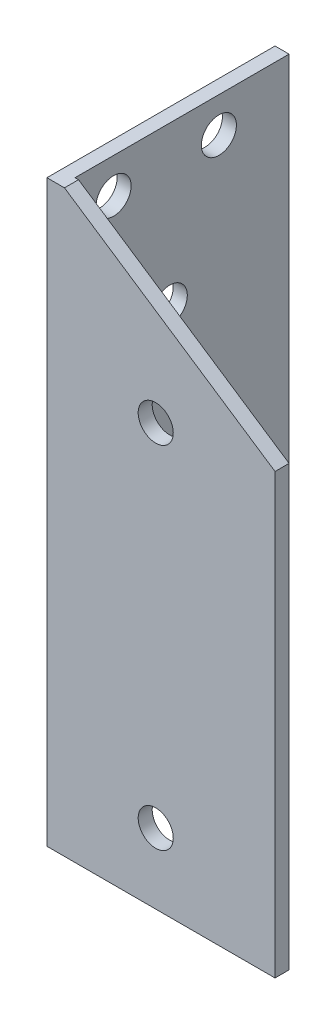
ISO-10303-21;
HEADER;
FILE_DESCRIPTION(('STEP AP214'),'2;1');
FILE_NAME('part.step','',(''),(''),'','','');
FILE_SCHEMA(('AUTOMOTIVE_DESIGN { 1 0 10303 214 1 1 1 1 }'));
ENDSEC;
DATA;
#1=APPLICATION_CONTEXT('core data for automotive mechanical design processes');
#2=APPLICATION_PROTOCOL_DEFINITION('international standard','automotive_design',2000,#1);
#3=PRODUCT_CONTEXT('',#1,'mechanical');
#4=PRODUCT('Part','Part','',(#3));
#5=PRODUCT_RELATED_PRODUCT_CATEGORY('part','',(#4));
#6=PRODUCT_DEFINITION_FORMATION('','',#4);
#7=PRODUCT_DEFINITION_CONTEXT('part definition',#1,'design');
#8=PRODUCT_DEFINITION('design','',#6,#7);
#9=PRODUCT_DEFINITION_SHAPE('','',#8);
#10=(LENGTH_UNIT() NAMED_UNIT(*) SI_UNIT(.MILLI.,.METRE.));
#11=(NAMED_UNIT(*) PLANE_ANGLE_UNIT() SI_UNIT($,.RADIAN.));
#12=(NAMED_UNIT(*) SI_UNIT($,.STERADIAN.) SOLID_ANGLE_UNIT());
#13=UNCERTAINTY_MEASURE_WITH_UNIT(LENGTH_MEASURE(1.E-05),#10,'distance_accuracy_value','');
#14=(GEOMETRIC_REPRESENTATION_CONTEXT(3) GLOBAL_UNCERTAINTY_ASSIGNED_CONTEXT((#13)) GLOBAL_UNIT_ASSIGNED_CONTEXT((#10,
#11,#12)) REPRESENTATION_CONTEXT('',''));
#15=CARTESIAN_POINT('',(0.,0.,0.));
#16=DIRECTION('',(0.,0.,1.));
#17=DIRECTION('',(1.,0.,0.));
#18=AXIS2_PLACEMENT_3D('',#15,#16,#17);
#19=CARTESIAN_POINT('',(4.,165.,0.));
#20=DIRECTION('',(-1.,0.,0.));
#21=DIRECTION('',(0.,0.,1.));
#22=AXIS2_PLACEMENT_3D('',#19,#20,#21);
#23=PLANE('',#22);
#24=CARTESIAN_POINT('',(4.,20.,-30.9999999999947));
#25=DIRECTION('',(-1.,0.,0.));
#26=DIRECTION('',(0.,0.,1.));
#27=AXIS2_PLACEMENT_3D('',#24,#25,#26);
#28=CIRCLE('',#27,4.99999999999998);
#29=CARTESIAN_POINT('',(4.,20.,-25.9999999999947));
#30=VERTEX_POINT('',#29);
#31=EDGE_CURVE('E140',#30,#30,#28,.T.);
#32=ORIENTED_EDGE('',*,*,#31,.T.);
#33=EDGE_LOOP('',(#32));
#34=FACE_BOUND('',#33,.T.);
#35=CARTESIAN_POINT('',(4.,155.,-15.));
#36=DIRECTION('',(-1.,0.,0.));
#37=DIRECTION('',(0.,0.,1.));
#38=AXIS2_PLACEMENT_3D('',#35,#36,#37);
#39=CIRCLE('',#38,5.);
#40=CARTESIAN_POINT('',(4.,155.,-10.));
#41=VERTEX_POINT('',#40);
#42=EDGE_CURVE('E137',#41,#41,#39,.T.);
#43=ORIENTED_EDGE('',*,*,#42,.T.);
#44=EDGE_LOOP('',(#43));
#45=FACE_BOUND('',#44,.T.);
#46=CARTESIAN_POINT('',(4.,155.,-45.));
#47=DIRECTION('',(-1.,0.,0.));
#48=DIRECTION('',(0.,0.,1.));
#49=AXIS2_PLACEMENT_3D('',#46,#47,#48);
#50=CIRCLE('',#49,5.00000000000001);
#51=CARTESIAN_POINT('',(4.,155.,-40.));
#52=VERTEX_POINT('',#51);
#53=EDGE_CURVE('E129',#52,#52,#50,.T.);
#54=ORIENTED_EDGE('',*,*,#53,.T.);
#55=EDGE_LOOP('',(#54));
#56=FACE_BOUND('',#55,.T.);
#57=CARTESIAN_POINT('',(4.,120.,-31.));
#58=DIRECTION('',(-1.,0.,0.));
#59=DIRECTION('',(0.,0.,1.));
#60=AXIS2_PLACEMENT_3D('',#57,#58,#59);
#61=CIRCLE('',#60,4.99999999999999);
#62=CARTESIAN_POINT('',(4.,120.,-26.));
#63=VERTEX_POINT('',#62);
#64=EDGE_CURVE('E146',#63,#63,#61,.T.);
#65=ORIENTED_EDGE('',*,*,#64,.T.);
#66=EDGE_LOOP('',(#65));
#67=FACE_BOUND('',#66,.T.);
#68=DIRECTION('',(0.,0.,-1.));
#69=VECTOR('',#68,1.);
#70=CARTESIAN_POINT('',(4.,0.,0.));
#71=LINE('',#70,#69);
#72=CARTESIAN_POINT('',(4.,0.,-4.));
#73=VERTEX_POINT('',#72);
#74=CARTESIAN_POINT('',(4.,0.,-65.));
#75=VERTEX_POINT('',#74);
#76=EDGE_CURVE('E163',#73,#75,#71,.T.);
#77=ORIENTED_EDGE('',*,*,#76,.T.);
#78=DIRECTION('',(0.,-1.,0.));
#79=VECTOR('',#78,1.);
#80=CARTESIAN_POINT('',(4.,165.,-65.));
#81=LINE('',#80,#79);
#82=CARTESIAN_POINT('',(4.,165.,-65.));
#83=VERTEX_POINT('',#82);
#84=EDGE_CURVE('E44',#83,#75,#81,.T.);
#85=ORIENTED_EDGE('',*,*,#84,.F.);
#86=DIRECTION('',(0.,0.,-1.));
#87=VECTOR('',#86,1.);
#88=CARTESIAN_POINT('',(4.,165.,0.));
#89=LINE('',#88,#87);
#90=CARTESIAN_POINT('',(4.,165.,-4.));
#91=VERTEX_POINT('',#90);
#92=EDGE_CURVE('E157',#91,#83,#89,.T.);
#93=ORIENTED_EDGE('',*,*,#92,.F.);
#94=DIRECTION('',(0.,-1.,0.));
#95=VECTOR('',#94,1.);
#96=CARTESIAN_POINT('',(4.,165.,-4.));
#97=LINE('',#96,#95);
#98=EDGE_CURVE('E162',#91,#73,#97,.T.);
#99=ORIENTED_EDGE('',*,*,#98,.T.);
#100=EDGE_LOOP('',(#77,#85,#93,#99));
#101=FACE_BOUND('',#100,.T.);
#102=ADVANCED_FACE('F37',(#34,#45,#56,#67,#101),#23,.F.);
#103=CARTESIAN_POINT('',(0.,165.,-65.));
#104=DIRECTION('',(0.,0.,-1.));
#105=DIRECTION('',(-1.,0.,0.));
#106=AXIS2_PLACEMENT_3D('',#103,#104,#105);
#107=PLANE('',#106);
#108=DIRECTION('',(1.,0.,0.));
#109=VECTOR('',#108,1.);
#110=CARTESIAN_POINT('',(0.,0.,-65.));
#111=LINE('',#110,#109);
#112=CARTESIAN_POINT('',(0.,0.,-65.));
#113=VERTEX_POINT('',#112);
#114=EDGE_CURVE('E166',#113,#75,#111,.T.);
#115=ORIENTED_EDGE('',*,*,#114,.F.);
#116=DIRECTION('',(0.,-1.,0.));
#117=VECTOR('',#116,1.);
#118=CARTESIAN_POINT('',(0.,165.,-65.));
#119=LINE('',#118,#117);
#120=CARTESIAN_POINT('',(0.,165.,-65.));
#121=VERTEX_POINT('',#120);
#122=EDGE_CURVE('E181',#121,#113,#119,.T.);
#123=ORIENTED_EDGE('',*,*,#122,.F.);
#124=DIRECTION('',(1.,0.,0.));
#125=VECTOR('',#124,1.);
#126=CARTESIAN_POINT('',(0.,165.,-65.));
#127=LINE('',#126,#125);
#128=EDGE_CURVE('E90',#121,#83,#127,.T.);
#129=ORIENTED_EDGE('',*,*,#128,.T.);
#130=ORIENTED_EDGE('',*,*,#84,.T.);
#131=EDGE_LOOP('',(#115,#123,#129,#130));
#132=FACE_BOUND('',#131,.T.);
#133=ADVANCED_FACE('F209',(#132),#107,.T.);
#134=CARTESIAN_POINT('',(0.,165.,0.));
#135=DIRECTION('',(-1.,0.,0.));
#136=DIRECTION('',(0.,0.,1.));
#137=AXIS2_PLACEMENT_3D('',#134,#135,#136);
#138=PLANE('',#137);
#139=CARTESIAN_POINT('',(0.,20.,-30.9999999999947));
#140=DIRECTION('',(-1.,0.,0.));
#141=DIRECTION('',(0.,0.,1.));
#142=AXIS2_PLACEMENT_3D('',#139,#140,#141);
#143=CIRCLE('',#142,4.99999999999998);
#144=CARTESIAN_POINT('',(0.,20.,-25.9999999999947));
#145=VERTEX_POINT('',#144);
#146=EDGE_CURVE('E126',#145,#145,#143,.T.);
#147=ORIENTED_EDGE('',*,*,#146,.F.);
#148=EDGE_LOOP('',(#147));
#149=FACE_BOUND('',#148,.T.);
#150=CARTESIAN_POINT('',(0.,155.,-15.));
#151=DIRECTION('',(-1.,0.,0.));
#152=DIRECTION('',(0.,0.,1.));
#153=AXIS2_PLACEMENT_3D('',#150,#151,#152);
#154=CIRCLE('',#153,5.);
#155=CARTESIAN_POINT('',(0.,155.,-10.));
#156=VERTEX_POINT('',#155);
#157=EDGE_CURVE('E130',#156,#156,#154,.T.);
#158=ORIENTED_EDGE('',*,*,#157,.F.);
#159=EDGE_LOOP('',(#158));
#160=FACE_BOUND('',#159,.T.);
#161=CARTESIAN_POINT('',(0.,155.,-45.));
#162=DIRECTION('',(-1.,0.,0.));
#163=DIRECTION('',(0.,0.,1.));
#164=AXIS2_PLACEMENT_3D('',#161,#162,#163);
#165=CIRCLE('',#164,5.00000000000001);
#166=CARTESIAN_POINT('',(0.,155.,-40.));
#167=VERTEX_POINT('',#166);
#168=EDGE_CURVE('E125',#167,#167,#165,.T.);
#169=ORIENTED_EDGE('',*,*,#168,.F.);
#170=EDGE_LOOP('',(#169));
#171=FACE_BOUND('',#170,.T.);
#172=CARTESIAN_POINT('',(0.,120.,-31.));
#173=DIRECTION('',(-1.,0.,0.));
#174=DIRECTION('',(0.,0.,1.));
#175=AXIS2_PLACEMENT_3D('',#172,#173,#174);
#176=CIRCLE('',#175,4.99999999999999);
#177=CARTESIAN_POINT('',(0.,120.,-26.));
#178=VERTEX_POINT('',#177);
#179=EDGE_CURVE('E143',#178,#178,#176,.T.);
#180=ORIENTED_EDGE('',*,*,#179,.F.);
#181=EDGE_LOOP('',(#180));
#182=FACE_BOUND('',#181,.T.);
#183=DIRECTION('',(0.,0.,-1.));
#184=VECTOR('',#183,1.);
#185=CARTESIAN_POINT('',(0.,0.,0.));
#186=LINE('',#185,#184);
#187=CARTESIAN_POINT('',(0.,0.,0.));
#188=VERTEX_POINT('',#187);
#189=EDGE_CURVE('E168',#188,#113,#186,.T.);
#190=ORIENTED_EDGE('',*,*,#189,.F.);
#191=DIRECTION('',(0.,-1.,0.));
#192=VECTOR('',#191,1.);
#193=CARTESIAN_POINT('',(0.,165.,0.));
#194=LINE('',#193,#192);
#195=CARTESIAN_POINT('',(0.,165.,0.));
#196=VERTEX_POINT('',#195);
#197=EDGE_CURVE('E179',#196,#188,#194,.T.);
#198=ORIENTED_EDGE('',*,*,#197,.F.);
#199=DIRECTION('',(0.,0.,-1.));
#200=VECTOR('',#199,1.);
#201=CARTESIAN_POINT('',(0.,165.,0.));
#202=LINE('',#201,#200);
#203=EDGE_CURVE('E109',#196,#121,#202,.T.);
#204=ORIENTED_EDGE('',*,*,#203,.T.);
#205=ORIENTED_EDGE('',*,*,#122,.T.);
#206=EDGE_LOOP('',(#190,#198,#204,#205));
#207=FACE_BOUND('',#206,.T.);
#208=ADVANCED_FACE('F214',(#149,#160,#171,#182,#207),#138,.T.);
#209=CARTESIAN_POINT('',(0.,165.,0.));
#210=DIRECTION('',(0.,0.,1.));
#211=DIRECTION('',(1.,0.,0.));
#212=AXIS2_PLACEMENT_3D('',#209,#210,#211);
#213=PLANE('',#212);
#214=DIRECTION('',(0.832050294337844,-0.554700196225229,0.));
#215=VECTOR('',#214,1.);
#216=CARTESIAN_POINT('',(5.00000000000001,165.,0.));
#217=LINE('',#216,#215);
#218=CARTESIAN_POINT('',(5.00000000000001,165.,0.));
#219=VERTEX_POINT('',#218);
#220=CARTESIAN_POINT('',(65.,125.,0.));
#221=VERTEX_POINT('',#220);
#222=EDGE_CURVE('E104',#219,#221,#217,.T.);
#223=ORIENTED_EDGE('',*,*,#222,.F.);
#224=DIRECTION('',(-1.,0.,0.));
#225=VECTOR('',#224,1.);
#226=CARTESIAN_POINT('',(0.,165.,0.));
#227=LINE('',#226,#225);
#228=EDGE_CURVE('E107',#219,#196,#227,.T.);
#229=ORIENTED_EDGE('',*,*,#228,.T.);
#230=ORIENTED_EDGE('',*,*,#197,.T.);
#231=DIRECTION('',(-1.,0.,0.));
#232=VECTOR('',#231,1.);
#233=CARTESIAN_POINT('',(0.,0.,0.));
#234=LINE('',#233,#232);
#235=CARTESIAN_POINT('',(65.,0.,0.));
#236=VERTEX_POINT('',#235);
#237=EDGE_CURVE('E170',#236,#188,#234,.T.);
#238=ORIENTED_EDGE('',*,*,#237,.F.);
#239=DIRECTION('',(0.,-1.,0.));
#240=VECTOR('',#239,1.);
#241=CARTESIAN_POINT('',(65.,165.,0.));
#242=LINE('',#241,#240);
#243=EDGE_CURVE('E119',#221,#236,#242,.T.);
#244=ORIENTED_EDGE('',*,*,#243,.F.);
#245=EDGE_LOOP('',(#223,#229,#230,#238,#244));
#246=FACE_BOUND('',#245,.T.);
#247=CARTESIAN_POINT('',(31.0000000000053,20.,0.));
#248=DIRECTION('',(0.,0.,1.));
#249=DIRECTION('',(1.,0.,0.));
#250=AXIS2_PLACEMENT_3D('',#247,#248,#249);
#251=CIRCLE('',#250,5.00000000000001);
#252=CARTESIAN_POINT('',(36.0000000000053,20.,0.));
#253=VERTEX_POINT('',#252);
#254=EDGE_CURVE('E149',#253,#253,#251,.T.);
#255=ORIENTED_EDGE('',*,*,#254,.F.);
#256=EDGE_LOOP('',(#255));
#257=FACE_BOUND('',#256,.T.);
#258=CARTESIAN_POINT('',(31.,120.,0.));
#259=DIRECTION('',(0.,0.,1.));
#260=DIRECTION('',(1.,0.,0.));
#261=AXIS2_PLACEMENT_3D('',#258,#259,#260);
#262=CIRCLE('',#261,4.99999999999999);
#263=CARTESIAN_POINT('',(36.,120.,0.));
#264=VERTEX_POINT('',#263);
#265=EDGE_CURVE('E153',#264,#264,#262,.T.);
#266=ORIENTED_EDGE('',*,*,#265,.F.);
#267=EDGE_LOOP('',(#266));
#268=FACE_BOUND('',#267,.T.);
#269=ADVANCED_FACE('F115',(#246,#257,#268),#213,.T.);
#270=CARTESIAN_POINT('',(65.,165.,-4.));
#271=DIRECTION('',(1.,0.,0.));
#272=DIRECTION('',(0.,0.,-1.));
#273=AXIS2_PLACEMENT_3D('',#270,#271,#272);
#274=PLANE('',#273);
#275=DIRECTION('',(0.,0.,1.));
#276=VECTOR('',#275,1.);
#277=CARTESIAN_POINT('',(65.,125.,-65.));
#278=LINE('',#277,#276);
#279=CARTESIAN_POINT('',(65.,125.,-4.));
#280=VERTEX_POINT('',#279);
#281=EDGE_CURVE('E120',#280,#221,#278,.T.);
#282=ORIENTED_EDGE('',*,*,#281,.T.);
#283=ORIENTED_EDGE('',*,*,#243,.T.);
#284=DIRECTION('',(0.,0.,1.));
#285=VECTOR('',#284,1.);
#286=CARTESIAN_POINT('',(65.,0.,-4.));
#287=LINE('',#286,#285);
#288=CARTESIAN_POINT('',(65.,0.,-4.));
#289=VERTEX_POINT('',#288);
#290=EDGE_CURVE('E172',#289,#236,#287,.T.);
#291=ORIENTED_EDGE('',*,*,#290,.F.);
#292=DIRECTION('',(0.,-1.,0.));
#293=VECTOR('',#292,1.);
#294=CARTESIAN_POINT('',(65.,165.,-4.));
#295=LINE('',#294,#293);
#296=EDGE_CURVE('E176',#280,#289,#295,.T.);
#297=ORIENTED_EDGE('',*,*,#296,.F.);
#298=EDGE_LOOP('',(#282,#283,#291,#297));
#299=FACE_BOUND('',#298,.T.);
#300=ADVANCED_FACE('F233',(#299),#274,.T.);
#301=CARTESIAN_POINT('',(0.,165.,-4.));
#302=DIRECTION('',(0.,0.,1.));
#303=DIRECTION('',(1.,0.,0.));
#304=AXIS2_PLACEMENT_3D('',#301,#302,#303);
#305=PLANE('',#304);
#306=CARTESIAN_POINT('',(31.0000000000053,20.,-4.));
#307=DIRECTION('',(0.,0.,1.));
#308=DIRECTION('',(1.,0.,0.));
#309=AXIS2_PLACEMENT_3D('',#306,#307,#308);
#310=CIRCLE('',#309,5.00000000000001);
#311=CARTESIAN_POINT('',(36.0000000000053,20.,-4.));
#312=VERTEX_POINT('',#311);
#313=EDGE_CURVE('E152',#312,#312,#310,.T.);
#314=ORIENTED_EDGE('',*,*,#313,.T.);
#315=EDGE_LOOP('',(#314));
#316=FACE_BOUND('',#315,.T.);
#317=CARTESIAN_POINT('',(31.,120.,-4.));
#318=DIRECTION('',(0.,0.,1.));
#319=DIRECTION('',(1.,0.,0.));
#320=AXIS2_PLACEMENT_3D('',#317,#318,#319);
#321=CIRCLE('',#320,4.99999999999999);
#322=CARTESIAN_POINT('',(36.,120.,-4.));
#323=VERTEX_POINT('',#322);
#324=EDGE_CURVE('E156',#323,#323,#321,.T.);
#325=ORIENTED_EDGE('',*,*,#324,.T.);
#326=EDGE_LOOP('',(#325));
#327=FACE_BOUND('',#326,.T.);
#328=DIRECTION('',(1.,0.,0.));
#329=VECTOR('',#328,1.);
#330=CARTESIAN_POINT('',(0.,165.,-4.));
#331=LINE('',#330,#329);
#332=CARTESIAN_POINT('',(5.00000000000001,165.,-4.));
#333=VERTEX_POINT('',#332);
#334=EDGE_CURVE('E55',#333,#91,#331,.F.);
#335=ORIENTED_EDGE('',*,*,#334,.F.);
#336=DIRECTION('',(0.832050294337844,-0.554700196225229,0.));
#337=VECTOR('',#336,1.);
#338=CARTESIAN_POINT('',(1.53846153846154,167.307692307692,-4.));
#339=LINE('',#338,#337);
#340=EDGE_CURVE('E105',#333,#280,#339,.T.);
#341=ORIENTED_EDGE('',*,*,#340,.T.);
#342=ORIENTED_EDGE('',*,*,#296,.T.);
#343=DIRECTION('',(1.,0.,0.));
#344=VECTOR('',#343,1.);
#345=CARTESIAN_POINT('',(0.,0.,-4.));
#346=LINE('',#345,#344);
#347=EDGE_CURVE('E82',#289,#73,#346,.F.);
#348=ORIENTED_EDGE('',*,*,#347,.T.);
#349=ORIENTED_EDGE('',*,*,#98,.F.);
#350=EDGE_LOOP('',(#335,#341,#342,#348,#349));
#351=FACE_BOUND('',#350,.T.);
#352=ADVANCED_FACE('F189',(#316,#327,#351),#305,.F.);
#353=CARTESIAN_POINT('',(0.,165.,0.));
#354=DIRECTION('',(0.,-1.,0.));
#355=DIRECTION('',(-1.,0.,0.));
#356=AXIS2_PLACEMENT_3D('',#353,#354,#355);
#357=PLANE('',#356);
#358=ORIENTED_EDGE('',*,*,#228,.F.);
#359=DIRECTION('',(0.,0.,-1.));
#360=VECTOR('',#359,1.);
#361=CARTESIAN_POINT('',(5.00000000000001,165.,0.));
#362=LINE('',#361,#360);
#363=EDGE_CURVE('E11',#219,#333,#362,.T.);
#364=ORIENTED_EDGE('',*,*,#363,.T.);
#365=ORIENTED_EDGE('',*,*,#334,.T.);
#366=ORIENTED_EDGE('',*,*,#92,.T.);
#367=ORIENTED_EDGE('',*,*,#128,.F.);
#368=ORIENTED_EDGE('',*,*,#203,.F.);
#369=EDGE_LOOP('',(#358,#364,#365,#366,#367,#368));
#370=FACE_BOUND('',#369,.T.);
#371=ADVANCED_FACE('F108',(#370),#357,.F.);
#372=CARTESIAN_POINT('',(0.,0.,0.));
#373=DIRECTION('',(0.,-1.,0.));
#374=DIRECTION('',(-1.,0.,0.));
#375=AXIS2_PLACEMENT_3D('',#372,#373,#374);
#376=PLANE('',#375);
#377=ORIENTED_EDGE('',*,*,#76,.F.);
#378=ORIENTED_EDGE('',*,*,#347,.F.);
#379=ORIENTED_EDGE('',*,*,#290,.T.);
#380=ORIENTED_EDGE('',*,*,#237,.T.);
#381=ORIENTED_EDGE('',*,*,#189,.T.);
#382=ORIENTED_EDGE('',*,*,#114,.T.);
#383=EDGE_LOOP('',(#377,#378,#379,#380,#381,#382));
#384=FACE_BOUND('',#383,.T.);
#385=ADVANCED_FACE('F205',(#384),#376,.T.);
#386=CARTESIAN_POINT('',(31.,120.,-10.));
#387=DIRECTION('',(0.,0.,1.));
#388=DIRECTION('',(1.,0.,0.));
#389=AXIS2_PLACEMENT_3D('',#386,#387,#388);
#390=CYLINDRICAL_SURFACE('',#389,4.99999999999999);
#391=ORIENTED_EDGE('',*,*,#265,.T.);
#392=EDGE_LOOP('',(#391));
#393=FACE_BOUND('',#392,.T.);
#394=ORIENTED_EDGE('',*,*,#324,.F.);
#395=EDGE_LOOP('',(#394));
#396=FACE_BOUND('',#395,.T.);
#397=ADVANCED_FACE('F195',(#393,#396),#390,.F.);
#398=CARTESIAN_POINT('',(31.0000000000053,20.,-10.));
#399=DIRECTION('',(0.,0.,1.));
#400=DIRECTION('',(1.,0.,0.));
#401=AXIS2_PLACEMENT_3D('',#398,#399,#400);
#402=CYLINDRICAL_SURFACE('',#401,5.00000000000001);
#403=ORIENTED_EDGE('',*,*,#254,.T.);
#404=EDGE_LOOP('',(#403));
#405=FACE_BOUND('',#404,.T.);
#406=ORIENTED_EDGE('',*,*,#313,.F.);
#407=EDGE_LOOP('',(#406));
#408=FACE_BOUND('',#407,.T.);
#409=ADVANCED_FACE('F192',(#405,#408),#402,.F.);
#410=CARTESIAN_POINT('',(10.,120.,-31.));
#411=DIRECTION('',(-1.,0.,0.));
#412=DIRECTION('',(0.,0.,1.));
#413=AXIS2_PLACEMENT_3D('',#410,#411,#412);
#414=CYLINDRICAL_SURFACE('',#413,4.99999999999999);
#415=ORIENTED_EDGE('',*,*,#179,.T.);
#416=EDGE_LOOP('',(#415));
#417=FACE_BOUND('',#416,.T.);
#418=ORIENTED_EDGE('',*,*,#64,.F.);
#419=EDGE_LOOP('',(#418));
#420=FACE_BOUND('',#419,.T.);
#421=ADVANCED_FACE('F194',(#417,#420),#414,.F.);
#422=CARTESIAN_POINT('',(10.,155.,-45.));
#423=DIRECTION('',(-1.,0.,0.));
#424=DIRECTION('',(0.,0.,1.));
#425=AXIS2_PLACEMENT_3D('',#422,#423,#424);
#426=CYLINDRICAL_SURFACE('',#425,5.00000000000001);
#427=ORIENTED_EDGE('',*,*,#168,.T.);
#428=EDGE_LOOP('',(#427));
#429=FACE_BOUND('',#428,.T.);
#430=ORIENTED_EDGE('',*,*,#53,.F.);
#431=EDGE_LOOP('',(#430));
#432=FACE_BOUND('',#431,.T.);
#433=ADVANCED_FACE('F202',(#429,#432),#426,.F.);
#434=CARTESIAN_POINT('',(10.,155.,-15.));
#435=DIRECTION('',(-1.,0.,0.));
#436=DIRECTION('',(0.,0.,1.));
#437=AXIS2_PLACEMENT_3D('',#434,#435,#436);
#438=CYLINDRICAL_SURFACE('',#437,5.);
#439=ORIENTED_EDGE('',*,*,#157,.T.);
#440=EDGE_LOOP('',(#439));
#441=FACE_BOUND('',#440,.T.);
#442=ORIENTED_EDGE('',*,*,#42,.F.);
#443=EDGE_LOOP('',(#442));
#444=FACE_BOUND('',#443,.T.);
#445=ADVANCED_FACE('F261',(#441,#444),#438,.F.);
#446=CARTESIAN_POINT('',(10.,20.,-30.9999999999947));
#447=DIRECTION('',(-1.,0.,0.));
#448=DIRECTION('',(0.,0.,1.));
#449=AXIS2_PLACEMENT_3D('',#446,#447,#448);
#450=CYLINDRICAL_SURFACE('',#449,4.99999999999998);
#451=ORIENTED_EDGE('',*,*,#146,.T.);
#452=EDGE_LOOP('',(#451));
#453=FACE_BOUND('',#452,.T.);
#454=ORIENTED_EDGE('',*,*,#31,.F.);
#455=EDGE_LOOP('',(#454));
#456=FACE_BOUND('',#455,.T.);
#457=ADVANCED_FACE('F266',(#453,#456),#450,.F.);
#458=CARTESIAN_POINT('',(5.00000000000001,165.,-65.));
#459=DIRECTION('',(-0.554700196225229,-0.832050294337844,0.));
#460=DIRECTION('',(0.832050294337844,-0.554700196225229,0.));
#461=AXIS2_PLACEMENT_3D('',#458,#459,#460);
#462=PLANE('',#461);
#463=ORIENTED_EDGE('',*,*,#363,.F.);
#464=ORIENTED_EDGE('',*,*,#222,.T.);
#465=ORIENTED_EDGE('',*,*,#281,.F.);
#466=ORIENTED_EDGE('',*,*,#340,.F.);
#467=EDGE_LOOP('',(#463,#464,#465,#466));
#468=FACE_BOUND('',#467,.T.);
#469=ADVANCED_FACE('F101',(#468),#462,.F.);
#470=CLOSED_SHELL('',(#102,#133,#208,#269,#300,#352,#371,#385,#397,#409,#421,#433,#445,#457,#469));
#471=MANIFOLD_SOLID_BREP('B2',#470);
#472=ADVANCED_BREP_SHAPE_REPRESENTATION('',(#18,#471),#14);
#473=SHAPE_DEFINITION_REPRESENTATION(#9,#472);
ENDSEC;
END-ISO-10303-21;
